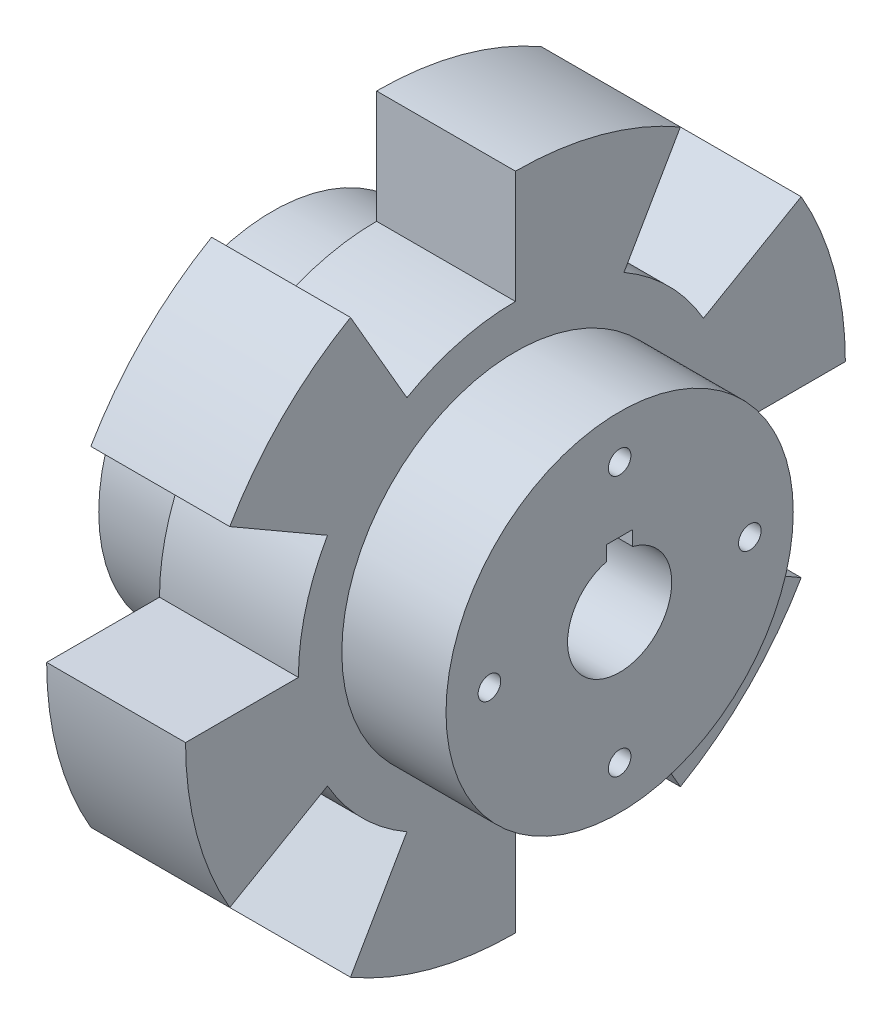
ISO-10303-21;
HEADER;
FILE_DESCRIPTION(('STEP AP214'),'2;1');
FILE_NAME('part.step','',(''),(''),'','','');
FILE_SCHEMA(('AUTOMOTIVE_DESIGN { 1 0 10303 214 1 1 1 1 }'));
ENDSEC;
DATA;
#1=APPLICATION_CONTEXT('core data for automotive mechanical design processes');
#2=APPLICATION_PROTOCOL_DEFINITION('international standard','automotive_design',2000,#1);
#3=PRODUCT_CONTEXT('',#1,'mechanical');
#4=PRODUCT('Part','Part','',(#3));
#5=PRODUCT_RELATED_PRODUCT_CATEGORY('part','',(#4));
#6=PRODUCT_DEFINITION_FORMATION('','',#4);
#7=PRODUCT_DEFINITION_CONTEXT('part definition',#1,'design');
#8=PRODUCT_DEFINITION('design','',#6,#7);
#9=PRODUCT_DEFINITION_SHAPE('','',#8);
#10=(LENGTH_UNIT() NAMED_UNIT(*) SI_UNIT(.MILLI.,.METRE.));
#11=(NAMED_UNIT(*) PLANE_ANGLE_UNIT() SI_UNIT($,.RADIAN.));
#12=(NAMED_UNIT(*) SI_UNIT($,.STERADIAN.) SOLID_ANGLE_UNIT());
#13=UNCERTAINTY_MEASURE_WITH_UNIT(LENGTH_MEASURE(1.E-05),#10,'distance_accuracy_value','');
#14=(GEOMETRIC_REPRESENTATION_CONTEXT(3) GLOBAL_UNCERTAINTY_ASSIGNED_CONTEXT((#13)) GLOBAL_UNIT_ASSIGNED_CONTEXT((#10,
#11,#12)) REPRESENTATION_CONTEXT('',''));
#15=CARTESIAN_POINT('',(0.,0.,0.));
#16=DIRECTION('',(0.,0.,1.));
#17=DIRECTION('',(1.,0.,0.));
#18=AXIS2_PLACEMENT_3D('',#15,#16,#17);
#19=CARTESIAN_POINT('',(0.,-20.,0.));
#20=DIRECTION('',(-1.,0.,0.));
#21=DIRECTION('',(0.,0.,1.));
#22=AXIS2_PLACEMENT_3D('',#19,#20,#21);
#23=CYLINDRICAL_SURFACE('',#22,38.);
#24=CARTESIAN_POINT('',(28.,-20.,0.));
#25=DIRECTION('',(-1.,0.,0.));
#26=DIRECTION('',(0.,0.,1.));
#27=AXIS2_PLACEMENT_3D('',#24,#25,#26);
#28=CIRCLE('',#27,38.);
#29=CARTESIAN_POINT('',(28.,18.,0.));
#30=VERTEX_POINT('',#29);
#31=CARTESIAN_POINT('',(28.,12.9089653438087,-19.));
#32=VERTEX_POINT('',#31);
#33=EDGE_CURVE('E641',#30,#32,#28,.T.);
#34=ORIENTED_EDGE('',*,*,#33,.T.);
#35=DIRECTION('',(-1.,0.,0.));
#36=VECTOR('',#35,1.);
#37=CARTESIAN_POINT('',(40.,12.9089653438087,-19.));
#38=LINE('',#37,#36);
#39=CARTESIAN_POINT('',(12.,12.9089653438087,-19.));
#40=VERTEX_POINT('',#39);
#41=EDGE_CURVE('E276',#32,#40,#38,.T.);
#42=ORIENTED_EDGE('',*,*,#41,.T.);
#43=CARTESIAN_POINT('',(12.,-20.,0.));
#44=DIRECTION('',(-1.,0.,0.));
#45=DIRECTION('',(0.,0.,1.));
#46=AXIS2_PLACEMENT_3D('',#43,#44,#45);
#47=CIRCLE('',#46,38.);
#48=CARTESIAN_POINT('',(12.,18.,0.));
#49=VERTEX_POINT('',#48);
#50=EDGE_CURVE('E592',#49,#40,#47,.T.);
#51=ORIENTED_EDGE('',*,*,#50,.F.);
#52=DIRECTION('',(-1.,0.,0.));
#53=VECTOR('',#52,1.);
#54=CARTESIAN_POINT('',(40.,18.,0.));
#55=LINE('',#54,#53);
#56=EDGE_CURVE('E283',#30,#49,#55,.T.);
#57=ORIENTED_EDGE('',*,*,#56,.F.);
#58=EDGE_LOOP('',(#34,#42,#51,#57));
#59=FACE_BOUND('',#58,.T.);
#60=ADVANCED_FACE('F39',(#59),#23,.T.);
#61=CARTESIAN_POINT('',(28.,-0.999999999999999,32.9089653438087));
#62=VERTEX_POINT('',#61);
#63=CARTESIAN_POINT('',(28.,12.9089653438081,18.9999999999996));
#64=VERTEX_POINT('',#63);
#65=EDGE_CURVE('E511',#62,#64,#28,.T.);
#66=ORIENTED_EDGE('',*,*,#65,.T.);
#67=DIRECTION('',(-1.,0.,0.));
#68=VECTOR('',#67,1.);
#69=CARTESIAN_POINT('',(40.,12.9089653438081,18.9999999999996));
#70=LINE('',#69,#68);
#71=CARTESIAN_POINT('',(12.,12.9089653438081,18.9999999999996));
#72=VERTEX_POINT('',#71);
#73=EDGE_CURVE('E284',#64,#72,#70,.T.);
#74=ORIENTED_EDGE('',*,*,#73,.T.);
#75=CARTESIAN_POINT('',(12.,-0.99999999999999,32.9089653438087));
#76=VERTEX_POINT('',#75);
#77=EDGE_CURVE('E505',#76,#72,#47,.T.);
#78=ORIENTED_EDGE('',*,*,#77,.F.);
#79=DIRECTION('',(-1.,0.,0.));
#80=VECTOR('',#79,1.);
#81=CARTESIAN_POINT('',(40.,-0.999999999999999,32.9089653438087));
#82=LINE('',#81,#80);
#83=EDGE_CURVE('E353',#62,#76,#82,.T.);
#84=ORIENTED_EDGE('',*,*,#83,.F.);
#85=EDGE_LOOP('',(#66,#74,#78,#84));
#86=FACE_BOUND('',#85,.T.);
#87=ADVANCED_FACE('F552',(#86),#23,.T.);
#88=CARTESIAN_POINT('',(28.,-39.,32.9089653438087));
#89=VERTEX_POINT('',#88);
#90=CARTESIAN_POINT('',(28.,-20.,38.));
#91=VERTEX_POINT('',#90);
#92=EDGE_CURVE('E506',#89,#91,#28,.T.);
#93=ORIENTED_EDGE('',*,*,#92,.T.);
#94=DIRECTION('',(-1.,0.,0.));
#95=VECTOR('',#94,1.);
#96=CARTESIAN_POINT('',(40.,-20.,38.));
#97=LINE('',#96,#95);
#98=CARTESIAN_POINT('',(12.,-20.,38.));
#99=VERTEX_POINT('',#98);
#100=EDGE_CURVE('E323',#91,#99,#97,.T.);
#101=ORIENTED_EDGE('',*,*,#100,.T.);
#102=CARTESIAN_POINT('',(12.,-39.,32.9089653438087));
#103=VERTEX_POINT('',#102);
#104=EDGE_CURVE('E500',#103,#99,#47,.T.);
#105=ORIENTED_EDGE('',*,*,#104,.F.);
#106=DIRECTION('',(-1.,0.,0.));
#107=VECTOR('',#106,1.);
#108=CARTESIAN_POINT('',(40.,-39.,32.9089653438087));
#109=LINE('',#108,#107);
#110=EDGE_CURVE('E55',#89,#103,#109,.T.);
#111=ORIENTED_EDGE('',*,*,#110,.F.);
#112=EDGE_LOOP('',(#93,#101,#105,#111));
#113=FACE_BOUND('',#112,.T.);
#114=ADVANCED_FACE('F559',(#113),#23,.T.);
#115=CARTESIAN_POINT('',(28.,-58.,0.));
#116=VERTEX_POINT('',#115);
#117=CARTESIAN_POINT('',(28.,-52.9089653438087,19.));
#118=VERTEX_POINT('',#117);
#119=EDGE_CURVE('E510',#116,#118,#28,.T.);
#120=ORIENTED_EDGE('',*,*,#119,.T.);
#121=DIRECTION('',(-1.,0.,0.));
#122=VECTOR('',#121,1.);
#123=CARTESIAN_POINT('',(40.,-52.9089653438087,19.));
#124=LINE('',#123,#122);
#125=CARTESIAN_POINT('',(12.,-52.9089653438087,19.));
#126=VERTEX_POINT('',#125);
#127=EDGE_CURVE('E330',#118,#126,#124,.T.);
#128=ORIENTED_EDGE('',*,*,#127,.T.);
#129=CARTESIAN_POINT('',(12.,-58.,0.));
#130=VERTEX_POINT('',#129);
#131=EDGE_CURVE('E504',#130,#126,#47,.T.);
#132=ORIENTED_EDGE('',*,*,#131,.F.);
#133=DIRECTION('',(-1.,0.,0.));
#134=VECTOR('',#133,1.);
#135=CARTESIAN_POINT('',(40.,-58.,0.));
#136=LINE('',#135,#134);
#137=EDGE_CURVE('E63',#116,#130,#136,.T.);
#138=ORIENTED_EDGE('',*,*,#137,.F.);
#139=EDGE_LOOP('',(#120,#128,#132,#138));
#140=FACE_BOUND('',#139,.T.);
#141=ADVANCED_FACE('F577',(#140),#23,.T.);
#142=CARTESIAN_POINT('',(12.,-1.00000000000004,-32.9089653438087));
#143=VERTEX_POINT('',#142);
#144=CARTESIAN_POINT('',(12.,-20.,-38.));
#145=VERTEX_POINT('',#144);
#146=EDGE_CURVE('E587',#143,#145,#47,.T.);
#147=ORIENTED_EDGE('',*,*,#146,.F.);
#148=DIRECTION('',(-1.,0.,0.));
#149=VECTOR('',#148,1.);
#150=CARTESIAN_POINT('',(40.,-1.00000000000004,-32.9089653438087));
#151=LINE('',#150,#149);
#152=CARTESIAN_POINT('',(28.,-1.00000000000004,-32.9089653438087));
#153=VERTEX_POINT('',#152);
#154=EDGE_CURVE('E307',#153,#143,#151,.T.);
#155=ORIENTED_EDGE('',*,*,#154,.F.);
#156=CARTESIAN_POINT('',(28.,-20.,-38.));
#157=VERTEX_POINT('',#156);
#158=EDGE_CURVE('E639',#153,#157,#28,.T.);
#159=ORIENTED_EDGE('',*,*,#158,.T.);
#160=DIRECTION('',(-1.,0.,0.));
#161=VECTOR('',#160,1.);
#162=CARTESIAN_POINT('',(40.,-20.,-38.));
#163=LINE('',#162,#161);
#164=EDGE_CURVE('E262',#157,#145,#163,.T.);
#165=ORIENTED_EDGE('',*,*,#164,.T.);
#166=EDGE_LOOP('',(#147,#155,#159,#165));
#167=FACE_BOUND('',#166,.T.);
#168=ADVANCED_FACE('F567',(#167),#23,.T.);
#169=CARTESIAN_POINT('',(0.,0.,0.));
#170=DIRECTION('',(1.,0.,0.));
#171=DIRECTION('',(0.,0.,-1.));
#172=AXIS2_PLACEMENT_3D('',#169,#170,#171);
#173=PLANE('',#172);
#174=CARTESIAN_POINT('',(0.,-5.00398695326765,0.));
#175=DIRECTION('',(-1.,0.,0.));
#176=DIRECTION('',(0.,0.,1.));
#177=AXIS2_PLACEMENT_3D('',#174,#175,#176);
#178=CIRCLE('',#177,1.3);
#179=CARTESIAN_POINT('',(0.,-5.00398695326765,1.29999999999995));
#180=VERTEX_POINT('',#179);
#181=EDGE_CURVE('E791',#180,#180,#178,.T.);
#182=ORIENTED_EDGE('',*,*,#181,.F.);
#183=EDGE_LOOP('',(#182));
#184=FACE_BOUND('',#183,.T.);
#185=CARTESIAN_POINT('',(0.,-20.,14.9960130467323));
#186=DIRECTION('',(-1.,0.,0.));
#187=DIRECTION('',(0.,0.,1.));
#188=AXIS2_PLACEMENT_3D('',#185,#186,#187);
#189=CIRCLE('',#188,1.3);
#190=CARTESIAN_POINT('',(0.,-20.,16.2960130467323));
#191=VERTEX_POINT('',#190);
#192=EDGE_CURVE('E799',#191,#191,#189,.T.);
#193=ORIENTED_EDGE('',*,*,#192,.F.);
#194=EDGE_LOOP('',(#193));
#195=FACE_BOUND('',#194,.T.);
#196=CARTESIAN_POINT('',(0.,-34.9960130467323,1.57074899129142E-13));
#197=DIRECTION('',(-1.,0.,0.));
#198=DIRECTION('',(0.,0.,1.));
#199=AXIS2_PLACEMENT_3D('',#196,#197,#198);
#200=CIRCLE('',#199,1.3);
#201=CARTESIAN_POINT('',(0.,-34.9960130467323,1.30000000000016));
#202=VERTEX_POINT('',#201);
#203=EDGE_CURVE('E809',#202,#202,#200,.T.);
#204=ORIENTED_EDGE('',*,*,#203,.F.);
#205=EDGE_LOOP('',(#204));
#206=FACE_BOUND('',#205,.T.);
#207=CARTESIAN_POINT('',(0.,-20.0000000000001,-14.9960130467323));
#208=DIRECTION('',(-1.,0.,0.));
#209=DIRECTION('',(0.,0.,1.));
#210=AXIS2_PLACEMENT_3D('',#207,#208,#209);
#211=CIRCLE('',#210,1.3);
#212=CARTESIAN_POINT('',(0.,-20.0000000000001,-13.6960130467323));
#213=VERTEX_POINT('',#212);
#214=EDGE_CURVE('E816',#213,#213,#211,.T.);
#215=ORIENTED_EDGE('',*,*,#214,.F.);
#216=EDGE_LOOP('',(#215));
#217=FACE_BOUND('',#216,.T.);
#218=DIRECTION('',(0.,0.,-1.));
#219=VECTOR('',#218,1.);
#220=CARTESIAN_POINT('',(0.,-12.5,0.));
#221=LINE('',#220,#219);
#222=CARTESIAN_POINT('',(0.,-12.5,1.5));
#223=VERTEX_POINT('',#222);
#224=CARTESIAN_POINT('',(0.,-12.5,-1.5));
#225=VERTEX_POINT('',#224);
#226=EDGE_CURVE('E461',#223,#225,#221,.T.);
#227=ORIENTED_EDGE('',*,*,#226,.F.);
#228=DIRECTION('',(0.,1.,0.));
#229=VECTOR('',#228,1.);
#230=CARTESIAN_POINT('',(0.,-12.5,1.5));
#231=LINE('',#230,#229);
#232=CARTESIAN_POINT('',(0.,-14.1905249806889,1.5));
#233=VERTEX_POINT('',#232);
#234=EDGE_CURVE('E472',#233,#223,#231,.T.);
#235=ORIENTED_EDGE('',*,*,#234,.F.);
#236=CARTESIAN_POINT('',(0.,-20.,0.));
#237=DIRECTION('',(-1.,0.,0.));
#238=DIRECTION('',(0.,0.,1.));
#239=AXIS2_PLACEMENT_3D('',#236,#237,#238);
#240=CIRCLE('',#239,6.);
#241=CARTESIAN_POINT('',(0.,-14.1905249806889,-1.5));
#242=VERTEX_POINT('',#241);
#243=EDGE_CURVE('E481',#242,#233,#240,.T.);
#244=ORIENTED_EDGE('',*,*,#243,.F.);
#245=DIRECTION('',(0.,-1.,0.));
#246=VECTOR('',#245,1.);
#247=CARTESIAN_POINT('',(0.,-14.6534990064201,-1.5));
#248=LINE('',#247,#246);
#249=EDGE_CURVE('E455',#225,#242,#248,.T.);
#250=ORIENTED_EDGE('',*,*,#249,.F.);
#251=EDGE_LOOP('',(#227,#235,#244,#250));
#252=FACE_BOUND('',#251,.T.);
#253=CARTESIAN_POINT('',(0.,-20.,0.));
#254=DIRECTION('',(-1.,0.,0.));
#255=DIRECTION('',(0.,0.,1.));
#256=AXIS2_PLACEMENT_3D('',#253,#254,#255);
#257=CIRCLE('',#256,20.);
#258=CARTESIAN_POINT('',(0.,-20.,20.));
#259=VERTEX_POINT('',#258);
#260=EDGE_CURVE('E489',#259,#259,#257,.T.);
#261=ORIENTED_EDGE('',*,*,#260,.T.);
#262=EDGE_LOOP('',(#261));
#263=FACE_BOUND('',#262,.T.);
#264=ADVANCED_FACE('F41',(#184,#195,#206,#217,#252,#263),#173,.F.);
#265=CARTESIAN_POINT('',(40.,0.,0.));
#266=DIRECTION('',(-1.,0.,0.));
#267=DIRECTION('',(0.,0.,1.));
#268=AXIS2_PLACEMENT_3D('',#265,#266,#267);
#269=PLANE('',#268);
#270=CARTESIAN_POINT('',(40.,-5.00398695326765,0.));
#271=DIRECTION('',(-1.,0.,0.));
#272=DIRECTION('',(0.,0.,1.));
#273=AXIS2_PLACEMENT_3D('',#270,#271,#272);
#274=CIRCLE('',#273,1.3);
#275=CARTESIAN_POINT('',(40.,-5.00398695326765,1.29999999999995));
#276=VERTEX_POINT('',#275);
#277=EDGE_CURVE('E250',#276,#276,#274,.T.);
#278=ORIENTED_EDGE('',*,*,#277,.T.);
#279=EDGE_LOOP('',(#278));
#280=FACE_BOUND('',#279,.T.);
#281=CARTESIAN_POINT('',(40.,-20.,14.9960130467323));
#282=DIRECTION('',(-1.,0.,0.));
#283=DIRECTION('',(0.,0.,1.));
#284=AXIS2_PLACEMENT_3D('',#281,#282,#283);
#285=CIRCLE('',#284,1.3);
#286=CARTESIAN_POINT('',(40.,-20.,16.2960130467323));
#287=VERTEX_POINT('',#286);
#288=EDGE_CURVE('E793',#287,#287,#285,.T.);
#289=ORIENTED_EDGE('',*,*,#288,.T.);
#290=EDGE_LOOP('',(#289));
#291=FACE_BOUND('',#290,.T.);
#292=CARTESIAN_POINT('',(40.,-34.9960130467323,1.57074899129142E-13));
#293=DIRECTION('',(-1.,0.,0.));
#294=DIRECTION('',(0.,0.,1.));
#295=AXIS2_PLACEMENT_3D('',#292,#293,#294);
#296=CIRCLE('',#295,1.3);
#297=CARTESIAN_POINT('',(40.,-34.9960130467323,1.30000000000016));
#298=VERTEX_POINT('',#297);
#299=EDGE_CURVE('E805',#298,#298,#296,.T.);
#300=ORIENTED_EDGE('',*,*,#299,.T.);
#301=EDGE_LOOP('',(#300));
#302=FACE_BOUND('',#301,.T.);
#303=CARTESIAN_POINT('',(40.,-20.0000000000001,-14.9960130467323));
#304=DIRECTION('',(-1.,0.,0.));
#305=DIRECTION('',(0.,0.,1.));
#306=AXIS2_PLACEMENT_3D('',#303,#304,#305);
#307=CIRCLE('',#306,1.3);
#308=CARTESIAN_POINT('',(40.,-20.0000000000001,-13.6960130467323));
#309=VERTEX_POINT('',#308);
#310=EDGE_CURVE('E813',#309,#309,#307,.T.);
#311=ORIENTED_EDGE('',*,*,#310,.T.);
#312=EDGE_LOOP('',(#311));
#313=FACE_BOUND('',#312,.T.);
#314=CARTESIAN_POINT('',(40.,-20.,0.));
#315=DIRECTION('',(-1.,0.,0.));
#316=DIRECTION('',(0.,0.,1.));
#317=AXIS2_PLACEMENT_3D('',#314,#315,#316);
#318=CIRCLE('',#317,6.);
#319=CARTESIAN_POINT('',(40.,-14.1905249806889,-1.5));
#320=VERTEX_POINT('',#319);
#321=CARTESIAN_POINT('',(40.,-14.1905249806889,1.5));
#322=VERTEX_POINT('',#321);
#323=EDGE_CURVE('E485',#320,#322,#318,.T.);
#324=ORIENTED_EDGE('',*,*,#323,.T.);
#325=DIRECTION('',(0.,1.,0.));
#326=VECTOR('',#325,1.);
#327=CARTESIAN_POINT('',(40.,-12.5,1.5));
#328=LINE('',#327,#326);
#329=CARTESIAN_POINT('',(40.,-12.5,1.5));
#330=VERTEX_POINT('',#329);
#331=EDGE_CURVE('E465',#322,#330,#328,.T.);
#332=ORIENTED_EDGE('',*,*,#331,.T.);
#333=DIRECTION('',(0.,0.,-1.));
#334=VECTOR('',#333,1.);
#335=CARTESIAN_POINT('',(40.,-12.5,-1.5));
#336=LINE('',#335,#334);
#337=CARTESIAN_POINT('',(40.,-12.5,-1.5));
#338=VERTEX_POINT('',#337);
#339=EDGE_CURVE('E456',#330,#338,#336,.T.);
#340=ORIENTED_EDGE('',*,*,#339,.T.);
#341=DIRECTION('',(0.,-1.,0.));
#342=VECTOR('',#341,1.);
#343=CARTESIAN_POINT('',(40.,-14.6534990064201,-1.5));
#344=LINE('',#343,#342);
#345=EDGE_CURVE('E460',#338,#320,#344,.T.);
#346=ORIENTED_EDGE('',*,*,#345,.T.);
#347=EDGE_LOOP('',(#324,#332,#340,#346));
#348=FACE_BOUND('',#347,.T.);
#349=CARTESIAN_POINT('',(40.,-20.,0.));
#350=DIRECTION('',(-1.,0.,0.));
#351=DIRECTION('',(0.,0.,1.));
#352=AXIS2_PLACEMENT_3D('',#349,#350,#351);
#353=CIRCLE('',#352,20.);
#354=CARTESIAN_POINT('',(40.,-20.,20.));
#355=VERTEX_POINT('',#354);
#356=EDGE_CURVE('E516',#355,#355,#353,.T.);
#357=ORIENTED_EDGE('',*,*,#356,.F.);
#358=EDGE_LOOP('',(#357));
#359=FACE_BOUND('',#358,.T.);
#360=ADVANCED_FACE('F538',(#280,#291,#302,#313,#348,#359),#269,.F.);
#361=CARTESIAN_POINT('',(0.,-20.,0.));
#362=DIRECTION('',(-1.,0.,0.));
#363=DIRECTION('',(0.,0.,1.));
#364=AXIS2_PLACEMENT_3D('',#361,#362,#363);
#365=CYLINDRICAL_SURFACE('',#364,20.);
#366=CARTESIAN_POINT('',(28.,-20.,0.));
#367=DIRECTION('',(-1.,0.,0.));
#368=DIRECTION('',(0.,0.,1.));
#369=AXIS2_PLACEMENT_3D('',#366,#367,#368);
#370=CIRCLE('',#369,20.);
#371=CARTESIAN_POINT('',(28.,-20.,20.));
#372=VERTEX_POINT('',#371);
#373=EDGE_CURVE('E512',#372,#372,#370,.T.);
#374=ORIENTED_EDGE('',*,*,#373,.F.);
#375=EDGE_LOOP('',(#374));
#376=FACE_BOUND('',#375,.T.);
#377=ORIENTED_EDGE('',*,*,#356,.T.);
#378=EDGE_LOOP('',(#377));
#379=FACE_BOUND('',#378,.T.);
#380=ADVANCED_FACE('F574',(#376,#379),#365,.T.);
#381=CARTESIAN_POINT('',(28.,18.,0.));
#382=DIRECTION('',(-1.,0.,0.));
#383=DIRECTION('',(0.,0.,1.));
#384=AXIS2_PLACEMENT_3D('',#381,#382,#383);
#385=PLANE('',#384);
#386=CARTESIAN_POINT('',(28.,-20.,0.));
#387=DIRECTION('',(-1.,0.,0.));
#388=DIRECTION('',(0.,0.,1.));
#389=AXIS2_PLACEMENT_3D('',#386,#387,#388);
#390=CIRCLE('',#389,25.0000000000001);
#391=CARTESIAN_POINT('',(28.,-7.50000000000003,-21.650635094611));
#392=VERTEX_POINT('',#391);
#393=CARTESIAN_POINT('',(28.,1.65063509461097,-12.5));
#394=VERTEX_POINT('',#393);
#395=EDGE_CURVE('E447',#392,#394,#390,.F.);
#396=ORIENTED_EDGE('',*,*,#395,.T.);
#397=DIRECTION('',(0.,0.866025403784439,-0.5));
#398=VECTOR('',#397,1.);
#399=CARTESIAN_POINT('',(28.,8.49999999999999,-16.4544826719043));
#400=LINE('',#399,#398);
#401=EDGE_CURVE('E451',#394,#32,#400,.T.);
#402=ORIENTED_EDGE('',*,*,#401,.T.);
#403=ORIENTED_EDGE('',*,*,#33,.F.);
#404=DIRECTION('',(0.,-1.,0.));
#405=VECTOR('',#404,1.);
#406=CARTESIAN_POINT('',(28.,18.,0.));
#407=LINE('',#406,#405);
#408=CARTESIAN_POINT('',(28.,5.00000000000002,0.));
#409=VERTEX_POINT('',#408);
#410=EDGE_CURVE('E431',#30,#409,#407,.T.);
#411=ORIENTED_EDGE('',*,*,#410,.T.);
#412=CARTESIAN_POINT('',(28.,-19.9999999999998,0.));
#413=DIRECTION('',(-1.,0.,0.));
#414=DIRECTION('',(0.,0.,1.));
#415=AXIS2_PLACEMENT_3D('',#412,#413,#414);
#416=CIRCLE('',#415,24.9999999999998);
#417=CARTESIAN_POINT('',(28.,1.65063509461099,12.5));
#418=VERTEX_POINT('',#417);
#419=EDGE_CURVE('E435',#409,#418,#416,.F.);
#420=ORIENTED_EDGE('',*,*,#419,.T.);
#421=DIRECTION('',(0.,0.866025403784441,0.499999999999997));
#422=VECTOR('',#421,1.);
#423=CARTESIAN_POINT('',(28.,8.5000000000001,16.4544826719043));
#424=LINE('',#423,#422);
#425=EDGE_CURVE('E439',#418,#64,#424,.T.);
#426=ORIENTED_EDGE('',*,*,#425,.T.);
#427=ORIENTED_EDGE('',*,*,#65,.F.);
#428=DIRECTION('',(0.,-0.5,-0.866025403784438));
#429=VECTOR('',#428,1.);
#430=CARTESIAN_POINT('',(28.,-10.5,16.4544826719043));
#431=LINE('',#430,#429);
#432=CARTESIAN_POINT('',(28.,-7.5,21.650635094611));
#433=VERTEX_POINT('',#432);
#434=EDGE_CURVE('E419',#62,#433,#431,.T.);
#435=ORIENTED_EDGE('',*,*,#434,.T.);
#436=CARTESIAN_POINT('',(28.,-20.,0.));
#437=DIRECTION('',(-1.,0.,0.));
#438=DIRECTION('',(0.,0.,1.));
#439=AXIS2_PLACEMENT_3D('',#436,#437,#438);
#440=CIRCLE('',#439,24.9999999999999);
#441=CARTESIAN_POINT('',(28.,-20.,25.));
#442=VERTEX_POINT('',#441);
#443=EDGE_CURVE('E423',#433,#442,#440,.F.);
#444=ORIENTED_EDGE('',*,*,#443,.T.);
#445=DIRECTION('',(0.,0.,1.));
#446=VECTOR('',#445,1.);
#447=CARTESIAN_POINT('',(28.,-20.,0.));
#448=LINE('',#447,#446);
#449=EDGE_CURVE('E427',#442,#91,#448,.T.);
#450=ORIENTED_EDGE('',*,*,#449,.T.);
#451=ORIENTED_EDGE('',*,*,#92,.F.);
#452=DIRECTION('',(0.,0.5,-0.866025403784439));
#453=VECTOR('',#452,1.);
#454=CARTESIAN_POINT('',(28.,-10.5,-16.4544826719043));
#455=LINE('',#454,#453);
#456=CARTESIAN_POINT('',(28.,-32.5,21.650635094611));
#457=VERTEX_POINT('',#456);
#458=EDGE_CURVE('E407',#89,#457,#455,.T.);
#459=ORIENTED_EDGE('',*,*,#458,.T.);
#460=CARTESIAN_POINT('',(28.,-19.9999999999999,-1.6306400674182E-13));
#461=DIRECTION('',(-1.,0.,0.));
#462=DIRECTION('',(0.,0.,1.));
#463=AXIS2_PLACEMENT_3D('',#460,#461,#462);
#464=CIRCLE('',#463,25.0000000000002);
#465=CARTESIAN_POINT('',(28.,-41.650635094611,12.5));
#466=VERTEX_POINT('',#465);
#467=EDGE_CURVE('E411',#457,#466,#464,.F.);
#468=ORIENTED_EDGE('',*,*,#467,.T.);
#469=DIRECTION('',(0.,-0.866025403784438,0.5));
#470=VECTOR('',#469,1.);
#471=CARTESIAN_POINT('',(28.,8.49999999999998,-16.4544826719044));
#472=LINE('',#471,#470);
#473=EDGE_CURVE('E415',#466,#118,#472,.T.);
#474=ORIENTED_EDGE('',*,*,#473,.T.);
#475=ORIENTED_EDGE('',*,*,#119,.F.);
#476=DIRECTION('',(0.,1.,0.));
#477=VECTOR('',#476,1.);
#478=CARTESIAN_POINT('',(28.,18.,0.));
#479=LINE('',#478,#477);
#480=CARTESIAN_POINT('',(28.,-45.,0.));
#481=VERTEX_POINT('',#480);
#482=EDGE_CURVE('E378',#116,#481,#479,.T.);
#483=ORIENTED_EDGE('',*,*,#482,.T.);
#484=CARTESIAN_POINT('',(28.,-20.,0.));
#485=DIRECTION('',(-1.,0.,0.));
#486=DIRECTION('',(0.,0.,1.));
#487=AXIS2_PLACEMENT_3D('',#484,#485,#486);
#488=CIRCLE('',#487,25.);
#489=CARTESIAN_POINT('',(28.,-41.650635094611,-12.5));
#490=VERTEX_POINT('',#489);
#491=EDGE_CURVE('E390',#481,#490,#488,.F.);
#492=ORIENTED_EDGE('',*,*,#491,.T.);
#493=DIRECTION('',(0.,-0.866025403784439,-0.499999999999999));
#494=VECTOR('',#493,1.);
#495=CARTESIAN_POINT('',(28.,8.50000000000003,16.4544826719043));
#496=LINE('',#495,#494);
#497=CARTESIAN_POINT('',(28.,-52.9089653438087,-19.));
#498=VERTEX_POINT('',#497);
#499=EDGE_CURVE('E394',#490,#498,#496,.T.);
#500=ORIENTED_EDGE('',*,*,#499,.T.);
#501=CARTESIAN_POINT('',(28.,-39.,-32.9089653438087));
#502=VERTEX_POINT('',#501);
#503=EDGE_CURVE('E636',#502,#498,#28,.T.);
#504=ORIENTED_EDGE('',*,*,#503,.F.);
#505=DIRECTION('',(0.,0.5,0.866025403784439));
#506=VECTOR('',#505,1.);
#507=CARTESIAN_POINT('',(28.,-10.5,16.4544826719043));
#508=LINE('',#507,#506);
#509=CARTESIAN_POINT('',(28.,-32.5,-21.650635094611));
#510=VERTEX_POINT('',#509);
#511=EDGE_CURVE('E398',#502,#510,#508,.T.);
#512=ORIENTED_EDGE('',*,*,#511,.T.);
#513=CARTESIAN_POINT('',(28.,-20.,0.));
#514=DIRECTION('',(-1.,0.,0.));
#515=DIRECTION('',(0.,0.,1.));
#516=AXIS2_PLACEMENT_3D('',#513,#514,#515);
#517=CIRCLE('',#516,25.);
#518=CARTESIAN_POINT('',(28.,-20.,-25.));
#519=VERTEX_POINT('',#518);
#520=EDGE_CURVE('E235',#510,#519,#517,.F.);
#521=ORIENTED_EDGE('',*,*,#520,.T.);
#522=DIRECTION('',(0.,0.,-1.));
#523=VECTOR('',#522,1.);
#524=CARTESIAN_POINT('',(28.,-20.,0.));
#525=LINE('',#524,#523);
#526=EDGE_CURVE('E403',#519,#157,#525,.T.);
#527=ORIENTED_EDGE('',*,*,#526,.T.);
#528=ORIENTED_EDGE('',*,*,#158,.F.);
#529=DIRECTION('',(0.,-0.499999999999999,0.866025403784439));
#530=VECTOR('',#529,1.);
#531=CARTESIAN_POINT('',(28.,-10.5,-16.4544826719043));
#532=LINE('',#531,#530);
#533=EDGE_CURVE('E443',#153,#392,#532,.T.);
#534=ORIENTED_EDGE('',*,*,#533,.T.);
#535=EDGE_LOOP('',(#396,#402,#403,#411,#420,#426,#427,#435,#444,#450,#451,#459,#468,#474,#475,
#483,#492,#500,#504,#512,#521,#527,#528,#534));
#536=FACE_BOUND('',#535,.T.);
#537=ORIENTED_EDGE('',*,*,#373,.T.);
#538=EDGE_LOOP('',(#537));
#539=FACE_BOUND('',#538,.T.);
#540=ADVANCED_FACE('F565',(#536,#539),#385,.F.);
#541=CARTESIAN_POINT('',(12.,-39.,-32.9089653438087));
#542=VERTEX_POINT('',#541);
#543=CARTESIAN_POINT('',(12.,-52.9089653438087,-19.));
#544=VERTEX_POINT('',#543);
#545=EDGE_CURVE('E593',#542,#544,#47,.T.);
#546=ORIENTED_EDGE('',*,*,#545,.F.);
#547=DIRECTION('',(-1.,0.,0.));
#548=VECTOR('',#547,1.);
#549=CARTESIAN_POINT('',(40.,-39.,-32.9089653438087));
#550=LINE('',#549,#548);
#551=EDGE_CURVE('E240',#502,#542,#550,.T.);
#552=ORIENTED_EDGE('',*,*,#551,.F.);
#553=ORIENTED_EDGE('',*,*,#503,.T.);
#554=DIRECTION('',(-1.,0.,0.));
#555=VECTOR('',#554,1.);
#556=CARTESIAN_POINT('',(40.,-52.9089653438087,-19.));
#557=LINE('',#556,#555);
#558=EDGE_CURVE('E374',#498,#544,#557,.T.);
#559=ORIENTED_EDGE('',*,*,#558,.T.);
#560=EDGE_LOOP('',(#546,#552,#553,#559));
#561=FACE_BOUND('',#560,.T.);
#562=ADVANCED_FACE('F555',(#561),#23,.T.);
#563=CARTESIAN_POINT('',(12.,0.,0.));
#564=DIRECTION('',(1.,0.,0.));
#565=DIRECTION('',(0.,0.,-1.));
#566=AXIS2_PLACEMENT_3D('',#563,#564,#565);
#567=PLANE('',#566);
#568=CARTESIAN_POINT('',(12.,-20.,0.));
#569=DIRECTION('',(-1.,0.,0.));
#570=DIRECTION('',(0.,0.,1.));
#571=AXIS2_PLACEMENT_3D('',#568,#569,#570);
#572=CIRCLE('',#571,20.);
#573=CARTESIAN_POINT('',(12.,-20.,20.));
#574=VERTEX_POINT('',#573);
#575=EDGE_CURVE('E496',#574,#574,#572,.T.);
#576=ORIENTED_EDGE('',*,*,#575,.F.);
#577=EDGE_LOOP('',(#576));
#578=FACE_BOUND('',#577,.T.);
#579=ORIENTED_EDGE('',*,*,#50,.T.);
#580=DIRECTION('',(0.,0.866025403784438,-0.5));
#581=VECTOR('',#580,1.);
#582=CARTESIAN_POINT('',(12.,12.9089653438087,-19.));
#583=LINE('',#582,#581);
#584=CARTESIAN_POINT('',(12.,1.65063509461097,-12.5));
#585=VERTEX_POINT('',#584);
#586=EDGE_CURVE('E304',#585,#40,#583,.T.);
#587=ORIENTED_EDGE('',*,*,#586,.F.);
#588=CARTESIAN_POINT('',(12.,-20.,0.));
#589=DIRECTION('',(1.,0.,0.));
#590=DIRECTION('',(0.,0.,-1.));
#591=AXIS2_PLACEMENT_3D('',#588,#589,#590);
#592=CIRCLE('',#591,25.0000000000001);
#593=CARTESIAN_POINT('',(12.,-7.50000000000003,-21.650635094611));
#594=VERTEX_POINT('',#593);
#595=EDGE_CURVE('E300',#594,#585,#592,.T.);
#596=ORIENTED_EDGE('',*,*,#595,.F.);
#597=DIRECTION('',(0.,-0.499999999999999,0.866025403784439));
#598=VECTOR('',#597,1.);
#599=CARTESIAN_POINT('',(12.,-1.00000000000004,-32.9089653438087));
#600=LINE('',#599,#598);
#601=EDGE_CURVE('E266',#143,#594,#600,.T.);
#602=ORIENTED_EDGE('',*,*,#601,.F.);
#603=ORIENTED_EDGE('',*,*,#146,.T.);
#604=DIRECTION('',(0.,0.,-1.));
#605=VECTOR('',#604,1.);
#606=CARTESIAN_POINT('',(12.,-20.,-38.));
#607=LINE('',#606,#605);
#608=CARTESIAN_POINT('',(12.,-20.,-25.));
#609=VERTEX_POINT('',#608);
#610=EDGE_CURVE('E255',#609,#145,#607,.T.);
#611=ORIENTED_EDGE('',*,*,#610,.F.);
#612=CARTESIAN_POINT('',(12.,-20.,0.));
#613=DIRECTION('',(1.,0.,0.));
#614=DIRECTION('',(0.,0.,1.));
#615=AXIS2_PLACEMENT_3D('',#612,#613,#614);
#616=CIRCLE('',#615,25.);
#617=CARTESIAN_POINT('',(12.,-32.5,-21.650635094611));
#618=VERTEX_POINT('',#617);
#619=EDGE_CURVE('E232',#618,#609,#616,.T.);
#620=ORIENTED_EDGE('',*,*,#619,.F.);
#621=DIRECTION('',(0.,0.5,0.866025403784439));
#622=VECTOR('',#621,1.);
#623=CARTESIAN_POINT('',(12.,-39.,-32.9089653438087));
#624=LINE('',#623,#622);
#625=EDGE_CURVE('E243',#542,#618,#624,.T.);
#626=ORIENTED_EDGE('',*,*,#625,.F.);
#627=ORIENTED_EDGE('',*,*,#545,.T.);
#628=DIRECTION('',(0.,-0.866025403784439,-0.499999999999999));
#629=VECTOR('',#628,1.);
#630=CARTESIAN_POINT('',(12.,-52.9089653438087,-19.));
#631=LINE('',#630,#629);
#632=CARTESIAN_POINT('',(12.,-41.650635094611,-12.5));
#633=VERTEX_POINT('',#632);
#634=EDGE_CURVE('E371',#633,#544,#631,.T.);
#635=ORIENTED_EDGE('',*,*,#634,.F.);
#636=CARTESIAN_POINT('',(12.,-20.,0.));
#637=DIRECTION('',(1.,0.,0.));
#638=DIRECTION('',(0.,0.,-1.));
#639=AXIS2_PLACEMENT_3D('',#636,#637,#638);
#640=CIRCLE('',#639,25.);
#641=CARTESIAN_POINT('',(12.,-45.,0.));
#642=VERTEX_POINT('',#641);
#643=EDGE_CURVE('E367',#642,#633,#640,.T.);
#644=ORIENTED_EDGE('',*,*,#643,.F.);
#645=DIRECTION('',(0.,1.,0.));
#646=VECTOR('',#645,1.);
#647=CARTESIAN_POINT('',(12.,-58.,0.));
#648=LINE('',#647,#646);
#649=EDGE_CURVE('E334',#130,#642,#648,.T.);
#650=ORIENTED_EDGE('',*,*,#649,.F.);
#651=ORIENTED_EDGE('',*,*,#131,.T.);
#652=DIRECTION('',(0.,-0.866025403784438,0.5));
#653=VECTOR('',#652,1.);
#654=CARTESIAN_POINT('',(12.,-52.9089653438087,19.));
#655=LINE('',#654,#653);
#656=CARTESIAN_POINT('',(12.,-41.650635094611,12.5));
#657=VERTEX_POINT('',#656);
#658=EDGE_CURVE('E327',#657,#126,#655,.T.);
#659=ORIENTED_EDGE('',*,*,#658,.F.);
#660=CARTESIAN_POINT('',(12.,-19.9999999999999,-1.6306400674182E-13));
#661=DIRECTION('',(1.,0.,0.));
#662=DIRECTION('',(0.,0.,-1.));
#663=AXIS2_PLACEMENT_3D('',#660,#661,#662);
#664=CIRCLE('',#663,25.0000000000002);
#665=CARTESIAN_POINT('',(12.,-32.5,21.650635094611));
#666=VERTEX_POINT('',#665);
#667=EDGE_CURVE('E322',#666,#657,#664,.T.);
#668=ORIENTED_EDGE('',*,*,#667,.F.);
#669=DIRECTION('',(0.,0.5,-0.866025403784439));
#670=VECTOR('',#669,1.);
#671=CARTESIAN_POINT('',(12.,-39.,32.9089653438087));
#672=LINE('',#671,#670);
#673=EDGE_CURVE('E319',#103,#666,#672,.T.);
#674=ORIENTED_EDGE('',*,*,#673,.F.);
#675=ORIENTED_EDGE('',*,*,#104,.T.);
#676=DIRECTION('',(0.,0.,1.));
#677=VECTOR('',#676,1.);
#678=CARTESIAN_POINT('',(12.,-20.,38.));
#679=LINE('',#678,#677);
#680=CARTESIAN_POINT('',(12.,-20.,25.));
#681=VERTEX_POINT('',#680);
#682=EDGE_CURVE('E350',#681,#99,#679,.T.);
#683=ORIENTED_EDGE('',*,*,#682,.F.);
#684=CARTESIAN_POINT('',(12.,-20.,0.));
#685=DIRECTION('',(1.,0.,0.));
#686=DIRECTION('',(0.,0.,-1.));
#687=AXIS2_PLACEMENT_3D('',#684,#685,#686);
#688=CIRCLE('',#687,24.9999999999999);
#689=CARTESIAN_POINT('',(12.,-7.5,21.650635094611));
#690=VERTEX_POINT('',#689);
#691=EDGE_CURVE('E346',#690,#681,#688,.T.);
#692=ORIENTED_EDGE('',*,*,#691,.F.);
#693=DIRECTION('',(0.,-0.5,-0.866025403784438));
#694=VECTOR('',#693,1.);
#695=CARTESIAN_POINT('',(12.,-0.999999999999999,32.9089653438087));
#696=LINE('',#695,#694);
#697=EDGE_CURVE('E288',#76,#690,#696,.T.);
#698=ORIENTED_EDGE('',*,*,#697,.F.);
#699=ORIENTED_EDGE('',*,*,#77,.T.);
#700=DIRECTION('',(0.,0.86602540378444,0.499999999999997));
#701=VECTOR('',#700,1.);
#702=CARTESIAN_POINT('',(12.,12.9089653438081,18.9999999999996));
#703=LINE('',#702,#701);
#704=CARTESIAN_POINT('',(12.,1.65063509461099,12.5));
#705=VERTEX_POINT('',#704);
#706=EDGE_CURVE('E280',#705,#72,#703,.T.);
#707=ORIENTED_EDGE('',*,*,#706,.F.);
#708=CARTESIAN_POINT('',(12.,-19.9999999999998,0.));
#709=DIRECTION('',(1.,0.,0.));
#710=DIRECTION('',(0.,0.,-1.));
#711=AXIS2_PLACEMENT_3D('',#708,#709,#710);
#712=CIRCLE('',#711,24.9999999999998);
#713=CARTESIAN_POINT('',(12.,5.00000000000002,0.));
#714=VERTEX_POINT('',#713);
#715=EDGE_CURVE('E275',#714,#705,#712,.T.);
#716=ORIENTED_EDGE('',*,*,#715,.F.);
#717=DIRECTION('',(0.,-1.,0.));
#718=VECTOR('',#717,1.);
#719=CARTESIAN_POINT('',(12.,18.,0.));
#720=LINE('',#719,#718);
#721=EDGE_CURVE('E271',#49,#714,#720,.T.);
#722=ORIENTED_EDGE('',*,*,#721,.F.);
#723=EDGE_LOOP('',(#579,#587,#596,#602,#603,#611,#620,#626,#627,#635,#644,#650,#651,#659,#668,
#674,#675,#683,#692,#698,#699,#707,#716,#722));
#724=FACE_BOUND('',#723,.T.);
#725=ADVANCED_FACE('F253',(#578,#724),#567,.F.);
#726=CARTESIAN_POINT('',(0.,-20.,0.));
#727=DIRECTION('',(-1.,0.,0.));
#728=DIRECTION('',(0.,0.,1.));
#729=AXIS2_PLACEMENT_3D('',#726,#727,#728);
#730=CYLINDRICAL_SURFACE('',#729,20.);
#731=ORIENTED_EDGE('',*,*,#260,.F.);
#732=EDGE_LOOP('',(#731));
#733=FACE_BOUND('',#732,.T.);
#734=ORIENTED_EDGE('',*,*,#575,.T.);
#735=EDGE_LOOP('',(#734));
#736=FACE_BOUND('',#735,.T.);
#737=ADVANCED_FACE('F572',(#733,#736),#730,.T.);
#738=CARTESIAN_POINT('',(40.,-20.,0.));
#739=DIRECTION('',(-1.,0.,0.));
#740=DIRECTION('',(0.,0.,1.));
#741=AXIS2_PLACEMENT_3D('',#738,#739,#740);
#742=CYLINDRICAL_SURFACE('',#741,6.);
#743=ORIENTED_EDGE('',*,*,#243,.T.);
#744=DIRECTION('',(-1.,0.,0.));
#745=VECTOR('',#744,1.);
#746=CARTESIAN_POINT('',(40.,-14.1905249806889,1.5));
#747=LINE('',#746,#745);
#748=EDGE_CURVE('E11',#233,#322,#747,.F.);
#749=ORIENTED_EDGE('',*,*,#748,.T.);
#750=ORIENTED_EDGE('',*,*,#323,.F.);
#751=DIRECTION('',(-1.,0.,0.));
#752=VECTOR('',#751,1.);
#753=CARTESIAN_POINT('',(40.,-14.1905249806889,-1.5));
#754=LINE('',#753,#752);
#755=EDGE_CURVE('E48',#320,#242,#754,.T.);
#756=ORIENTED_EDGE('',*,*,#755,.T.);
#757=EDGE_LOOP('',(#743,#749,#750,#756));
#758=FACE_BOUND('',#757,.T.);
#759=ADVANCED_FACE('F524',(#758),#742,.F.);
#760=CARTESIAN_POINT('',(40.,-12.5,1.5));
#761=DIRECTION('',(0.,0.,1.));
#762=DIRECTION('',(1.,0.,0.));
#763=AXIS2_PLACEMENT_3D('',#760,#761,#762);
#764=PLANE('',#763);
#765=ORIENTED_EDGE('',*,*,#234,.T.);
#766=DIRECTION('',(-1.,0.,0.));
#767=VECTOR('',#766,1.);
#768=CARTESIAN_POINT('',(40.,-12.5,1.5));
#769=LINE('',#768,#767);
#770=EDGE_CURVE('E477',#330,#223,#769,.T.);
#771=ORIENTED_EDGE('',*,*,#770,.F.);
#772=ORIENTED_EDGE('',*,*,#331,.F.);
#773=ORIENTED_EDGE('',*,*,#748,.F.);
#774=EDGE_LOOP('',(#765,#771,#772,#773));
#775=FACE_BOUND('',#774,.T.);
#776=ADVANCED_FACE('F534',(#775),#764,.F.);
#777=CARTESIAN_POINT('',(40.,-14.6534990064201,-1.5));
#778=DIRECTION('',(0.,0.,-1.));
#779=DIRECTION('',(-1.,0.,0.));
#780=AXIS2_PLACEMENT_3D('',#777,#778,#779);
#781=PLANE('',#780);
#782=ORIENTED_EDGE('',*,*,#345,.F.);
#783=DIRECTION('',(-1.,0.,0.));
#784=VECTOR('',#783,1.);
#785=CARTESIAN_POINT('',(40.,-12.5,-1.5));
#786=LINE('',#785,#784);
#787=EDGE_CURVE('E469',#338,#225,#786,.T.);
#788=ORIENTED_EDGE('',*,*,#787,.T.);
#789=ORIENTED_EDGE('',*,*,#249,.T.);
#790=ORIENTED_EDGE('',*,*,#755,.F.);
#791=EDGE_LOOP('',(#782,#788,#789,#790));
#792=FACE_BOUND('',#791,.T.);
#793=ADVANCED_FACE('F540',(#792),#781,.F.);
#794=CARTESIAN_POINT('',(40.,-12.5,0.));
#795=DIRECTION('',(0.,1.,0.));
#796=DIRECTION('',(0.,0.,1.));
#797=AXIS2_PLACEMENT_3D('',#794,#795,#796);
#798=PLANE('',#797);
#799=ORIENTED_EDGE('',*,*,#226,.T.);
#800=ORIENTED_EDGE('',*,*,#787,.F.);
#801=ORIENTED_EDGE('',*,*,#339,.F.);
#802=ORIENTED_EDGE('',*,*,#770,.T.);
#803=EDGE_LOOP('',(#799,#800,#801,#802));
#804=FACE_BOUND('',#803,.T.);
#805=ADVANCED_FACE('F536',(#804),#798,.F.);
#806=CARTESIAN_POINT('',(40.,-52.9089653438087,-19.));
#807=DIRECTION('',(0.,0.499999999999999,-0.866025403784439));
#808=DIRECTION('',(0.,0.866025403784439,0.499999999999999));
#809=AXIS2_PLACEMENT_3D('',#806,#807,#808);
#810=PLANE('',#809);
#811=DIRECTION('',(-1.,0.,0.));
#812=VECTOR('',#811,1.);
#813=CARTESIAN_POINT('',(40.,-41.650635094611,-12.5));
#814=LINE('',#813,#812);
#815=EDGE_CURVE('E379',#490,#633,#814,.T.);
#816=ORIENTED_EDGE('',*,*,#815,.T.);
#817=ORIENTED_EDGE('',*,*,#634,.T.);
#818=ORIENTED_EDGE('',*,*,#558,.F.);
#819=ORIENTED_EDGE('',*,*,#499,.F.);
#820=EDGE_LOOP('',(#816,#817,#818,#819));
#821=FACE_BOUND('',#820,.T.);
#822=ADVANCED_FACE('F547',(#821),#810,.F.);
#823=CARTESIAN_POINT('',(40.,-20.,0.));
#824=DIRECTION('',(-1.,0.,0.));
#825=DIRECTION('',(0.,0.,1.));
#826=AXIS2_PLACEMENT_3D('',#823,#824,#825);
#827=CYLINDRICAL_SURFACE('',#826,25.);
#828=DIRECTION('',(-1.,0.,0.));
#829=VECTOR('',#828,1.);
#830=CARTESIAN_POINT('',(40.,-45.,0.));
#831=LINE('',#830,#829);
#832=EDGE_CURVE('E382',#481,#642,#831,.T.);
#833=ORIENTED_EDGE('',*,*,#832,.T.);
#834=ORIENTED_EDGE('',*,*,#643,.T.);
#835=ORIENTED_EDGE('',*,*,#815,.F.);
#836=ORIENTED_EDGE('',*,*,#491,.F.);
#837=EDGE_LOOP('',(#833,#834,#835,#836));
#838=FACE_BOUND('',#837,.T.);
#839=ADVANCED_FACE('F692',(#838),#827,.T.);
#840=CARTESIAN_POINT('',(40.,-58.,0.));
#841=DIRECTION('',(0.,0.,1.));
#842=DIRECTION('',(1.,0.,0.));
#843=AXIS2_PLACEMENT_3D('',#840,#841,#842);
#844=PLANE('',#843);
#845=ORIENTED_EDGE('',*,*,#137,.T.);
#846=ORIENTED_EDGE('',*,*,#649,.T.);
#847=ORIENTED_EDGE('',*,*,#832,.F.);
#848=ORIENTED_EDGE('',*,*,#482,.F.);
#849=EDGE_LOOP('',(#845,#846,#847,#848));
#850=FACE_BOUND('',#849,.T.);
#851=ADVANCED_FACE('F696',(#850),#844,.F.);
#852=CARTESIAN_POINT('',(40.,-20.,-38.));
#853=DIRECTION('',(0.,1.,0.));
#854=DIRECTION('',(0.,0.,1.));
#855=AXIS2_PLACEMENT_3D('',#852,#853,#854);
#856=PLANE('',#855);
#857=DIRECTION('',(-1.,0.,0.));
#858=VECTOR('',#857,1.);
#859=CARTESIAN_POINT('',(40.,-20.,-25.));
#860=LINE('',#859,#858);
#861=EDGE_CURVE('E239',#519,#609,#860,.T.);
#862=ORIENTED_EDGE('',*,*,#861,.T.);
#863=ORIENTED_EDGE('',*,*,#610,.T.);
#864=ORIENTED_EDGE('',*,*,#164,.F.);
#865=ORIENTED_EDGE('',*,*,#526,.F.);
#866=EDGE_LOOP('',(#862,#863,#864,#865));
#867=FACE_BOUND('',#866,.T.);
#868=ADVANCED_FACE('F699',(#867),#856,.F.);
#869=CARTESIAN_POINT('',(40.,-20.,0.));
#870=DIRECTION('',(-1.,0.,0.));
#871=DIRECTION('',(0.,0.,1.));
#872=AXIS2_PLACEMENT_3D('',#869,#870,#871);
#873=CYLINDRICAL_SURFACE('',#872,25.);
#874=DIRECTION('',(-1.,0.,0.));
#875=VECTOR('',#874,1.);
#876=CARTESIAN_POINT('',(40.,-32.5,-21.650635094611));
#877=LINE('',#876,#875);
#878=EDGE_CURVE('E227',#510,#618,#877,.T.);
#879=ORIENTED_EDGE('',*,*,#878,.T.);
#880=ORIENTED_EDGE('',*,*,#619,.T.);
#881=ORIENTED_EDGE('',*,*,#861,.F.);
#882=ORIENTED_EDGE('',*,*,#520,.F.);
#883=EDGE_LOOP('',(#879,#880,#881,#882));
#884=FACE_BOUND('',#883,.T.);
#885=ADVANCED_FACE('F229',(#884),#873,.T.);
#886=CARTESIAN_POINT('',(40.,-39.,-32.9089653438087));
#887=DIRECTION('',(0.,-0.866025403784439,0.5));
#888=DIRECTION('',(0.,-0.5,-0.866025403784439));
#889=AXIS2_PLACEMENT_3D('',#886,#887,#888);
#890=PLANE('',#889);
#891=ORIENTED_EDGE('',*,*,#551,.T.);
#892=ORIENTED_EDGE('',*,*,#625,.T.);
#893=ORIENTED_EDGE('',*,*,#878,.F.);
#894=ORIENTED_EDGE('',*,*,#511,.F.);
#895=EDGE_LOOP('',(#891,#892,#893,#894));
#896=FACE_BOUND('',#895,.T.);
#897=ADVANCED_FACE('F244',(#896),#890,.F.);
#898=CARTESIAN_POINT('',(40.,-52.9089653438087,19.));
#899=DIRECTION('',(0.,-0.5,-0.866025403784438));
#900=DIRECTION('',(0.,0.866025403784438,-0.5));
#901=AXIS2_PLACEMENT_3D('',#898,#899,#900);
#902=PLANE('',#901);
#903=DIRECTION('',(-1.,0.,0.));
#904=VECTOR('',#903,1.);
#905=CARTESIAN_POINT('',(40.,-41.650635094611,12.5));
#906=LINE('',#905,#904);
#907=EDGE_CURVE('E335',#466,#657,#906,.T.);
#908=ORIENTED_EDGE('',*,*,#907,.T.);
#909=ORIENTED_EDGE('',*,*,#658,.T.);
#910=ORIENTED_EDGE('',*,*,#127,.F.);
#911=ORIENTED_EDGE('',*,*,#473,.F.);
#912=EDGE_LOOP('',(#908,#909,#910,#911));
#913=FACE_BOUND('',#912,.T.);
#914=ADVANCED_FACE('F606',(#913),#902,.F.);
#915=CARTESIAN_POINT('',(40.,-19.9999999999999,-1.6306400674182E-13));
#916=DIRECTION('',(-1.,0.,0.));
#917=DIRECTION('',(0.,0.,1.));
#918=AXIS2_PLACEMENT_3D('',#915,#916,#917);
#919=CYLINDRICAL_SURFACE('',#918,25.0000000000002);
#920=DIRECTION('',(-1.,0.,0.));
#921=VECTOR('',#920,1.);
#922=CARTESIAN_POINT('',(40.,-32.5,21.650635094611));
#923=LINE('',#922,#921);
#924=EDGE_CURVE('E338',#457,#666,#923,.T.);
#925=ORIENTED_EDGE('',*,*,#924,.T.);
#926=ORIENTED_EDGE('',*,*,#667,.T.);
#927=ORIENTED_EDGE('',*,*,#907,.F.);
#928=ORIENTED_EDGE('',*,*,#467,.F.);
#929=EDGE_LOOP('',(#925,#926,#927,#928));
#930=FACE_BOUND('',#929,.T.);
#931=ADVANCED_FACE('F612',(#930),#919,.T.);
#932=CARTESIAN_POINT('',(40.,-39.,32.9089653438087));
#933=DIRECTION('',(0.,0.866025403784439,0.5));
#934=DIRECTION('',(0.,-0.5,0.866025403784439));
#935=AXIS2_PLACEMENT_3D('',#932,#933,#934);
#936=PLANE('',#935);
#937=ORIENTED_EDGE('',*,*,#110,.T.);
#938=ORIENTED_EDGE('',*,*,#673,.T.);
#939=ORIENTED_EDGE('',*,*,#924,.F.);
#940=ORIENTED_EDGE('',*,*,#458,.F.);
#941=EDGE_LOOP('',(#937,#938,#939,#940));
#942=FACE_BOUND('',#941,.T.);
#943=ADVANCED_FACE('F613',(#942),#936,.F.);
#944=CARTESIAN_POINT('',(40.,-20.,38.));
#945=DIRECTION('',(0.,-1.,0.));
#946=DIRECTION('',(0.,0.,-1.));
#947=AXIS2_PLACEMENT_3D('',#944,#945,#946);
#948=PLANE('',#947);
#949=DIRECTION('',(-1.,0.,0.));
#950=VECTOR('',#949,1.);
#951=CARTESIAN_POINT('',(40.,-20.,25.));
#952=LINE('',#951,#950);
#953=EDGE_CURVE('E357',#442,#681,#952,.T.);
#954=ORIENTED_EDGE('',*,*,#953,.T.);
#955=ORIENTED_EDGE('',*,*,#682,.T.);
#956=ORIENTED_EDGE('',*,*,#100,.F.);
#957=ORIENTED_EDGE('',*,*,#449,.F.);
#958=EDGE_LOOP('',(#954,#955,#956,#957));
#959=FACE_BOUND('',#958,.T.);
#960=ADVANCED_FACE('F618',(#959),#948,.F.);
#961=CARTESIAN_POINT('',(40.,-20.,0.));
#962=DIRECTION('',(-1.,0.,0.));
#963=DIRECTION('',(0.,0.,1.));
#964=AXIS2_PLACEMENT_3D('',#961,#962,#963);
#965=CYLINDRICAL_SURFACE('',#964,24.9999999999999);
#966=DIRECTION('',(-1.,0.,0.));
#967=VECTOR('',#966,1.);
#968=CARTESIAN_POINT('',(40.,-7.5,21.650635094611));
#969=LINE('',#968,#967);
#970=EDGE_CURVE('E360',#433,#690,#969,.T.);
#971=ORIENTED_EDGE('',*,*,#970,.T.);
#972=ORIENTED_EDGE('',*,*,#691,.T.);
#973=ORIENTED_EDGE('',*,*,#953,.F.);
#974=ORIENTED_EDGE('',*,*,#443,.F.);
#975=EDGE_LOOP('',(#971,#972,#973,#974));
#976=FACE_BOUND('',#975,.T.);
#977=ADVANCED_FACE('F623',(#976),#965,.T.);
#978=CARTESIAN_POINT('',(40.,-0.999999999999999,32.9089653438087));
#979=DIRECTION('',(0.,0.866025403784438,-0.5));
#980=DIRECTION('',(0.,0.5,0.866025403784438));
#981=AXIS2_PLACEMENT_3D('',#978,#979,#980);
#982=PLANE('',#981);
#983=ORIENTED_EDGE('',*,*,#83,.T.);
#984=ORIENTED_EDGE('',*,*,#697,.T.);
#985=ORIENTED_EDGE('',*,*,#970,.F.);
#986=ORIENTED_EDGE('',*,*,#434,.F.);
#987=EDGE_LOOP('',(#983,#984,#985,#986));
#988=FACE_BOUND('',#987,.T.);
#989=ADVANCED_FACE('F625',(#988),#982,.F.);
#990=CARTESIAN_POINT('',(40.,12.9089653438081,18.9999999999996));
#991=DIRECTION('',(0.,-0.499999999999997,0.86602540378444));
#992=DIRECTION('',(0.,-0.866025403784441,-0.499999999999997));
#993=AXIS2_PLACEMENT_3D('',#990,#991,#992);
#994=PLANE('',#993);
#995=DIRECTION('',(-1.,0.,0.));
#996=VECTOR('',#995,1.);
#997=CARTESIAN_POINT('',(40.,1.65063509461099,12.5));
#998=LINE('',#997,#996);
#999=EDGE_CURVE('E289',#418,#705,#998,.T.);
#1000=ORIENTED_EDGE('',*,*,#999,.T.);
#1001=ORIENTED_EDGE('',*,*,#706,.T.);
#1002=ORIENTED_EDGE('',*,*,#73,.F.);
#1003=ORIENTED_EDGE('',*,*,#425,.F.);
#1004=EDGE_LOOP('',(#1000,#1001,#1002,#1003));
#1005=FACE_BOUND('',#1004,.T.);
#1006=ADVANCED_FACE('F645',(#1005),#994,.F.);
#1007=CARTESIAN_POINT('',(40.,-19.9999999999998,0.));
#1008=DIRECTION('',(-1.,0.,0.));
#1009=DIRECTION('',(0.,0.,1.));
#1010=AXIS2_PLACEMENT_3D('',#1007,#1008,#1009);
#1011=CYLINDRICAL_SURFACE('',#1010,24.9999999999998);
#1012=DIRECTION('',(-1.,0.,0.));
#1013=VECTOR('',#1012,1.);
#1014=CARTESIAN_POINT('',(40.,5.00000000000002,0.));
#1015=LINE('',#1014,#1013);
#1016=EDGE_CURVE('E292',#409,#714,#1015,.T.);
#1017=ORIENTED_EDGE('',*,*,#1016,.T.);
#1018=ORIENTED_EDGE('',*,*,#715,.T.);
#1019=ORIENTED_EDGE('',*,*,#999,.F.);
#1020=ORIENTED_EDGE('',*,*,#419,.F.);
#1021=EDGE_LOOP('',(#1017,#1018,#1019,#1020));
#1022=FACE_BOUND('',#1021,.T.);
#1023=ADVANCED_FACE('F647',(#1022),#1011,.T.);
#1024=CARTESIAN_POINT('',(40.,18.,0.));
#1025=DIRECTION('',(0.,0.,-1.));
#1026=DIRECTION('',(0.,1.,0.));
#1027=AXIS2_PLACEMENT_3D('',#1024,#1025,#1026);
#1028=PLANE('',#1027);
#1029=ORIENTED_EDGE('',*,*,#56,.T.);
#1030=ORIENTED_EDGE('',*,*,#721,.T.);
#1031=ORIENTED_EDGE('',*,*,#1016,.F.);
#1032=ORIENTED_EDGE('',*,*,#410,.F.);
#1033=EDGE_LOOP('',(#1029,#1030,#1031,#1032));
#1034=FACE_BOUND('',#1033,.T.);
#1035=ADVANCED_FACE('F717',(#1034),#1028,.F.);
#1036=CARTESIAN_POINT('',(40.,12.9089653438087,-19.));
#1037=DIRECTION('',(0.,0.5,0.866025403784438));
#1038=DIRECTION('',(0.,-0.866025403784439,0.5));
#1039=AXIS2_PLACEMENT_3D('',#1036,#1037,#1038);
#1040=PLANE('',#1039);
#1041=DIRECTION('',(-1.,0.,0.));
#1042=VECTOR('',#1041,1.);
#1043=CARTESIAN_POINT('',(40.,1.65063509461097,-12.5));
#1044=LINE('',#1043,#1042);
#1045=EDGE_CURVE('E311',#394,#585,#1044,.T.);
#1046=ORIENTED_EDGE('',*,*,#1045,.T.);
#1047=ORIENTED_EDGE('',*,*,#586,.T.);
#1048=ORIENTED_EDGE('',*,*,#41,.F.);
#1049=ORIENTED_EDGE('',*,*,#401,.F.);
#1050=EDGE_LOOP('',(#1046,#1047,#1048,#1049));
#1051=FACE_BOUND('',#1050,.T.);
#1052=ADVANCED_FACE('F657',(#1051),#1040,.F.);
#1053=CARTESIAN_POINT('',(40.,-20.,0.));
#1054=DIRECTION('',(-1.,0.,0.));
#1055=DIRECTION('',(0.,0.,1.));
#1056=AXIS2_PLACEMENT_3D('',#1053,#1054,#1055);
#1057=CYLINDRICAL_SURFACE('',#1056,25.0000000000001);
#1058=DIRECTION('',(-1.,0.,0.));
#1059=VECTOR('',#1058,1.);
#1060=CARTESIAN_POINT('',(40.,-7.50000000000003,-21.650635094611));
#1061=LINE('',#1060,#1059);
#1062=EDGE_CURVE('E314',#392,#594,#1061,.T.);
#1063=ORIENTED_EDGE('',*,*,#1062,.T.);
#1064=ORIENTED_EDGE('',*,*,#595,.T.);
#1065=ORIENTED_EDGE('',*,*,#1045,.F.);
#1066=ORIENTED_EDGE('',*,*,#395,.F.);
#1067=EDGE_LOOP('',(#1063,#1064,#1065,#1066));
#1068=FACE_BOUND('',#1067,.T.);
#1069=ADVANCED_FACE('F661',(#1068),#1057,.T.);
#1070=CARTESIAN_POINT('',(40.,-1.00000000000004,-32.9089653438087));
#1071=DIRECTION('',(0.,-0.866025403784439,-0.499999999999999));
#1072=DIRECTION('',(0.,0.499999999999999,-0.866025403784439));
#1073=AXIS2_PLACEMENT_3D('',#1070,#1071,#1072);
#1074=PLANE('',#1073);
#1075=ORIENTED_EDGE('',*,*,#154,.T.);
#1076=ORIENTED_EDGE('',*,*,#601,.T.);
#1077=ORIENTED_EDGE('',*,*,#1062,.F.);
#1078=ORIENTED_EDGE('',*,*,#533,.F.);
#1079=EDGE_LOOP('',(#1075,#1076,#1077,#1078));
#1080=FACE_BOUND('',#1079,.T.);
#1081=ADVANCED_FACE('F663',(#1080),#1074,.F.);
#1082=CARTESIAN_POINT('',(40.,-20.0000000000001,-14.9960130467323));
#1083=DIRECTION('',(-1.,0.,0.));
#1084=DIRECTION('',(0.,0.,1.));
#1085=AXIS2_PLACEMENT_3D('',#1082,#1083,#1084);
#1086=CYLINDRICAL_SURFACE('',#1085,1.3);
#1087=ORIENTED_EDGE('',*,*,#310,.F.);
#1088=EDGE_LOOP('',(#1087));
#1089=FACE_BOUND('',#1088,.T.);
#1090=ORIENTED_EDGE('',*,*,#214,.T.);
#1091=EDGE_LOOP('',(#1090));
#1092=FACE_BOUND('',#1091,.T.);
#1093=ADVANCED_FACE('F666',(#1089,#1092),#1086,.F.);
#1094=CARTESIAN_POINT('',(40.,-34.9960130467323,1.57074899129142E-13));
#1095=DIRECTION('',(-1.,0.,0.));
#1096=DIRECTION('',(0.,0.,1.));
#1097=AXIS2_PLACEMENT_3D('',#1094,#1095,#1096);
#1098=CYLINDRICAL_SURFACE('',#1097,1.3);
#1099=ORIENTED_EDGE('',*,*,#299,.F.);
#1100=EDGE_LOOP('',(#1099));
#1101=FACE_BOUND('',#1100,.T.);
#1102=ORIENTED_EDGE('',*,*,#203,.T.);
#1103=EDGE_LOOP('',(#1102));
#1104=FACE_BOUND('',#1103,.T.);
#1105=ADVANCED_FACE('F672',(#1101,#1104),#1098,.F.);
#1106=CARTESIAN_POINT('',(40.,-20.,14.9960130467323));
#1107=DIRECTION('',(-1.,0.,0.));
#1108=DIRECTION('',(0.,0.,1.));
#1109=AXIS2_PLACEMENT_3D('',#1106,#1107,#1108);
#1110=CYLINDRICAL_SURFACE('',#1109,1.3);
#1111=ORIENTED_EDGE('',*,*,#288,.F.);
#1112=EDGE_LOOP('',(#1111));
#1113=FACE_BOUND('',#1112,.T.);
#1114=ORIENTED_EDGE('',*,*,#192,.T.);
#1115=EDGE_LOOP('',(#1114));
#1116=FACE_BOUND('',#1115,.T.);
#1117=ADVANCED_FACE('F763',(#1113,#1116),#1110,.F.);
#1118=CARTESIAN_POINT('',(40.,-5.00398695326765,0.));
#1119=DIRECTION('',(-1.,0.,0.));
#1120=DIRECTION('',(0.,0.,1.));
#1121=AXIS2_PLACEMENT_3D('',#1118,#1119,#1120);
#1122=CYLINDRICAL_SURFACE('',#1121,1.3);
#1123=ORIENTED_EDGE('',*,*,#277,.F.);
#1124=EDGE_LOOP('',(#1123));
#1125=FACE_BOUND('',#1124,.T.);
#1126=ORIENTED_EDGE('',*,*,#181,.T.);
#1127=EDGE_LOOP('',(#1126));
#1128=FACE_BOUND('',#1127,.T.);
#1129=ADVANCED_FACE('F772',(#1125,#1128),#1122,.F.);
#1130=CLOSED_SHELL('',(#60,#87,#114,#141,#168,#264,#360,#380,#540,#562,#725,#737,#759,#776,#793,
#805,#822,#839,#851,#868,#885,#897,#914,#931,#943,#960,#977,#989,#1006,#1023,#1035,#1052,#1069,
#1081,#1093,#1105,#1117,#1129));
#1131=MANIFOLD_SOLID_BREP('B2',#1130);
#1132=ADVANCED_BREP_SHAPE_REPRESENTATION('',(#18,#1131),#14);
#1133=SHAPE_DEFINITION_REPRESENTATION(#9,#1132);
ENDSEC;
END-ISO-10303-21;
